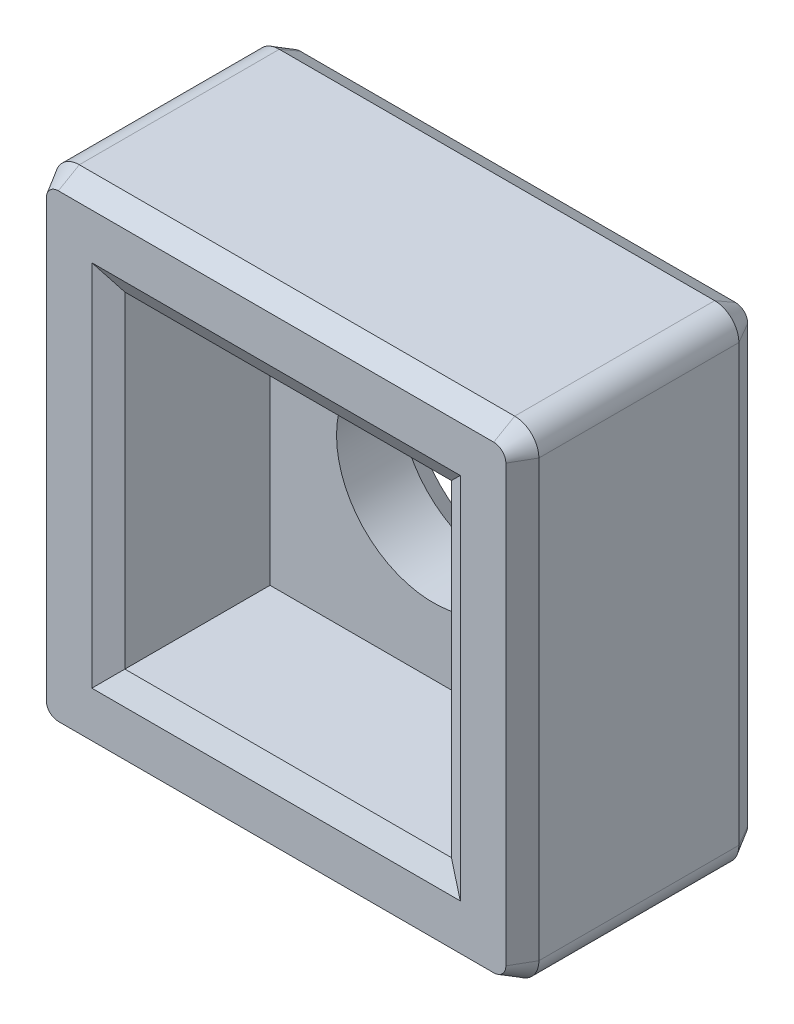
ISO-10303-21;
HEADER;
FILE_DESCRIPTION(('STEP AP214'),'2;1');
FILE_NAME('part.step','',(''),(''),'','','');
FILE_SCHEMA(('AUTOMOTIVE_DESIGN { 1 0 10303 214 1 1 1 1 }'));
ENDSEC;
DATA;
#1=APPLICATION_CONTEXT('core data for automotive mechanical design processes');
#2=APPLICATION_PROTOCOL_DEFINITION('international standard','automotive_design',2000,#1);
#3=PRODUCT_CONTEXT('',#1,'mechanical');
#4=PRODUCT('Part','Part','',(#3));
#5=PRODUCT_RELATED_PRODUCT_CATEGORY('part','',(#4));
#6=PRODUCT_DEFINITION_FORMATION('','',#4);
#7=PRODUCT_DEFINITION_CONTEXT('part definition',#1,'design');
#8=PRODUCT_DEFINITION('design','',#6,#7);
#9=PRODUCT_DEFINITION_SHAPE('','',#8);
#10=(LENGTH_UNIT() NAMED_UNIT(*) SI_UNIT(.MILLI.,.METRE.));
#11=(NAMED_UNIT(*) PLANE_ANGLE_UNIT() SI_UNIT($,.RADIAN.));
#12=(NAMED_UNIT(*) SI_UNIT($,.STERADIAN.) SOLID_ANGLE_UNIT());
#13=UNCERTAINTY_MEASURE_WITH_UNIT(LENGTH_MEASURE(1.E-05),#10,'distance_accuracy_value','');
#14=(GEOMETRIC_REPRESENTATION_CONTEXT(3) GLOBAL_UNCERTAINTY_ASSIGNED_CONTEXT((#13)) GLOBAL_UNIT_ASSIGNED_CONTEXT((#10,
#11,#12)) REPRESENTATION_CONTEXT('',''));
#15=CARTESIAN_POINT('',(0.,0.,0.));
#16=DIRECTION('',(0.,0.,1.));
#17=DIRECTION('',(1.,0.,0.));
#18=AXIS2_PLACEMENT_3D('',#15,#16,#17);
#19=CARTESIAN_POINT('',(0.,0.,4.));
#20=DIRECTION('',(0.,0.,-1.));
#21=DIRECTION('',(-1.,0.,0.));
#22=AXIS2_PLACEMENT_3D('',#19,#20,#21);
#23=CYLINDRICAL_SURFACE('',#22,1.6);
#24=CARTESIAN_POINT('',(0.,0.,0.346410161513775));
#25=DIRECTION('',(0.,0.,1.));
#26=DIRECTION('',(1.,0.,0.));
#27=AXIS2_PLACEMENT_3D('',#24,#25,#26);
#28=CIRCLE('',#27,1.6);
#29=CARTESIAN_POINT('',(1.6,0.,0.346410161513775));
#30=VERTEX_POINT('',#29);
#31=EDGE_CURVE('E351',#30,#30,#28,.F.);
#32=ORIENTED_EDGE('',*,*,#31,.T.);
#33=EDGE_LOOP('',(#32));
#34=FACE_BOUND('',#33,.T.);
#35=CARTESIAN_POINT('',(0.,0.,1.4));
#36=DIRECTION('',(0.,0.,1.));
#37=DIRECTION('',(1.,0.,0.));
#38=AXIS2_PLACEMENT_3D('',#35,#36,#37);
#39=CIRCLE('',#38,1.6);
#40=CARTESIAN_POINT('',(1.6,0.,1.4));
#41=VERTEX_POINT('',#40);
#42=EDGE_CURVE('E221',#41,#41,#39,.T.);
#43=ORIENTED_EDGE('',*,*,#42,.T.);
#44=EDGE_LOOP('',(#43));
#45=FACE_BOUND('',#44,.T.);
#46=ADVANCED_FACE('F43',(#34,#45),#23,.F.);
#47=CARTESIAN_POINT('',(-4.,4.,4.));
#48=DIRECTION('',(1.,0.,0.));
#49=DIRECTION('',(0.,0.,-1.));
#50=AXIS2_PLACEMENT_3D('',#47,#48,#49);
#51=PLANE('',#50);
#52=DIRECTION('',(0.,0.,-1.));
#53=VECTOR('',#52,1.);
#54=CARTESIAN_POINT('',(-4.,3.6,4.));
#55=LINE('',#54,#53);
#56=CARTESIAN_POINT('',(-4.,3.6,3.65358983848622));
#57=VERTEX_POINT('',#56);
#58=CARTESIAN_POINT('',(-4.,3.6,0.346410161513775));
#59=VERTEX_POINT('',#58);
#60=EDGE_CURVE('E248',#57,#59,#55,.T.);
#61=ORIENTED_EDGE('',*,*,#60,.T.);
#62=DIRECTION('',(0.,-1.,0.));
#63=VECTOR('',#62,1.);
#64=CARTESIAN_POINT('',(-4.,4.,0.346410161513775));
#65=LINE('',#64,#63);
#66=CARTESIAN_POINT('',(-4.,-3.6,0.346410161513775));
#67=VERTEX_POINT('',#66);
#68=EDGE_CURVE('E336',#59,#67,#65,.T.);
#69=ORIENTED_EDGE('',*,*,#68,.T.);
#70=DIRECTION('',(0.,0.,-1.));
#71=VECTOR('',#70,1.);
#72=CARTESIAN_POINT('',(-4.,-3.6,4.));
#73=LINE('',#72,#71);
#74=CARTESIAN_POINT('',(-4.,-3.6,3.65358983848622));
#75=VERTEX_POINT('',#74);
#76=EDGE_CURVE('E252',#67,#75,#73,.F.);
#77=ORIENTED_EDGE('',*,*,#76,.T.);
#78=DIRECTION('',(0.,1.,0.));
#79=VECTOR('',#78,1.);
#80=CARTESIAN_POINT('',(-4.,3.6,3.65358983848622));
#81=LINE('',#80,#79);
#82=EDGE_CURVE('E333',#75,#57,#81,.T.);
#83=ORIENTED_EDGE('',*,*,#82,.T.);
#84=EDGE_LOOP('',(#61,#69,#77,#83));
#85=FACE_BOUND('',#84,.T.);
#86=ADVANCED_FACE('F499',(#85),#51,.F.);
#87=CARTESIAN_POINT('',(-4.,-4.,4.));
#88=DIRECTION('',(0.,1.,0.));
#89=DIRECTION('',(0.,0.,1.));
#90=AXIS2_PLACEMENT_3D('',#87,#88,#89);
#91=PLANE('',#90);
#92=DIRECTION('',(0.,0.,-1.));
#93=VECTOR('',#92,1.);
#94=CARTESIAN_POINT('',(-3.6,-4.,4.));
#95=LINE('',#94,#93);
#96=CARTESIAN_POINT('',(-3.6,-4.,3.65358983848622));
#97=VERTEX_POINT('',#96);
#98=CARTESIAN_POINT('',(-3.6,-4.,0.346410161513775));
#99=VERTEX_POINT('',#98);
#100=EDGE_CURVE('E244',#97,#99,#95,.T.);
#101=ORIENTED_EDGE('',*,*,#100,.T.);
#102=DIRECTION('',(1.,0.,0.));
#103=VECTOR('',#102,1.);
#104=CARTESIAN_POINT('',(-4.,-4.,0.346410161513775));
#105=LINE('',#104,#103);
#106=CARTESIAN_POINT('',(3.6,-4.,0.346410161513775));
#107=VERTEX_POINT('',#106);
#108=EDGE_CURVE('E348',#99,#107,#105,.T.);
#109=ORIENTED_EDGE('',*,*,#108,.T.);
#110=DIRECTION('',(0.,0.,-1.));
#111=VECTOR('',#110,1.);
#112=CARTESIAN_POINT('',(3.6,-4.,4.));
#113=LINE('',#112,#111);
#114=CARTESIAN_POINT('',(3.6,-4.,3.65358983848622));
#115=VERTEX_POINT('',#114);
#116=EDGE_CURVE('E235',#107,#115,#113,.F.);
#117=ORIENTED_EDGE('',*,*,#116,.T.);
#118=DIRECTION('',(-1.,0.,0.));
#119=VECTOR('',#118,1.);
#120=CARTESIAN_POINT('',(-3.6,-4.,3.65358983848622));
#121=LINE('',#120,#119);
#122=EDGE_CURVE('E345',#115,#97,#121,.T.);
#123=ORIENTED_EDGE('',*,*,#122,.T.);
#124=EDGE_LOOP('',(#101,#109,#117,#123));
#125=FACE_BOUND('',#124,.T.);
#126=ADVANCED_FACE('F505',(#125),#91,.F.);
#127=CARTESIAN_POINT('',(4.,4.,4.));
#128=DIRECTION('',(-1.,0.,0.));
#129=DIRECTION('',(0.,-1.,0.));
#130=AXIS2_PLACEMENT_3D('',#127,#128,#129);
#131=PLANE('',#130);
#132=DIRECTION('',(0.,0.,-1.));
#133=VECTOR('',#132,1.);
#134=CARTESIAN_POINT('',(4.,-3.6,4.));
#135=LINE('',#134,#133);
#136=CARTESIAN_POINT('',(4.,-3.6,3.65358983848622));
#137=VERTEX_POINT('',#136);
#138=CARTESIAN_POINT('',(4.,-3.6,0.346410161513775));
#139=VERTEX_POINT('',#138);
#140=EDGE_CURVE('E260',#137,#139,#135,.T.);
#141=ORIENTED_EDGE('',*,*,#140,.T.);
#142=DIRECTION('',(0.,1.,0.));
#143=VECTOR('',#142,1.);
#144=CARTESIAN_POINT('',(4.,4.,0.346410161513775));
#145=LINE('',#144,#143);
#146=CARTESIAN_POINT('',(4.,3.6,0.346410161513775));
#147=VERTEX_POINT('',#146);
#148=EDGE_CURVE('E311',#139,#147,#145,.T.);
#149=ORIENTED_EDGE('',*,*,#148,.T.);
#150=DIRECTION('',(0.,0.,-1.));
#151=VECTOR('',#150,1.);
#152=CARTESIAN_POINT('',(4.,3.6,4.));
#153=LINE('',#152,#151);
#154=CARTESIAN_POINT('',(4.,3.6,3.65358983848622));
#155=VERTEX_POINT('',#154);
#156=EDGE_CURVE('E256',#147,#155,#153,.F.);
#157=ORIENTED_EDGE('',*,*,#156,.T.);
#158=DIRECTION('',(0.,-1.,0.));
#159=VECTOR('',#158,1.);
#160=CARTESIAN_POINT('',(4.,-3.6,3.65358983848622));
#161=LINE('',#160,#159);
#162=EDGE_CURVE('E308',#155,#137,#161,.T.);
#163=ORIENTED_EDGE('',*,*,#162,.T.);
#164=EDGE_LOOP('',(#141,#149,#157,#163));
#165=FACE_BOUND('',#164,.T.);
#166=ADVANCED_FACE('F522',(#165),#131,.F.);
#167=CARTESIAN_POINT('',(-4.,4.,4.));
#168=DIRECTION('',(0.,-1.,0.));
#169=DIRECTION('',(0.,0.,-1.));
#170=AXIS2_PLACEMENT_3D('',#167,#168,#169);
#171=PLANE('',#170);
#172=DIRECTION('',(0.,0.,-1.));
#173=VECTOR('',#172,1.);
#174=CARTESIAN_POINT('',(3.6,4.,4.));
#175=LINE('',#174,#173);
#176=CARTESIAN_POINT('',(3.6,4.,3.65358983848622));
#177=VERTEX_POINT('',#176);
#178=CARTESIAN_POINT('',(3.6,4.,0.346410161513775));
#179=VERTEX_POINT('',#178);
#180=EDGE_CURVE('E268',#177,#179,#175,.T.);
#181=ORIENTED_EDGE('',*,*,#180,.T.);
#182=DIRECTION('',(-1.,0.,0.));
#183=VECTOR('',#182,1.);
#184=CARTESIAN_POINT('',(-4.,4.,0.346410161513775));
#185=LINE('',#184,#183);
#186=CARTESIAN_POINT('',(-3.6,4.,0.346410161513775));
#187=VERTEX_POINT('',#186);
#188=EDGE_CURVE('E323',#179,#187,#185,.T.);
#189=ORIENTED_EDGE('',*,*,#188,.T.);
#190=DIRECTION('',(0.,0.,-1.));
#191=VECTOR('',#190,1.);
#192=CARTESIAN_POINT('',(-3.6,4.,4.));
#193=LINE('',#192,#191);
#194=CARTESIAN_POINT('',(-3.6,4.,3.65358983848622));
#195=VERTEX_POINT('',#194);
#196=EDGE_CURVE('E264',#187,#195,#193,.F.);
#197=ORIENTED_EDGE('',*,*,#196,.T.);
#198=DIRECTION('',(1.,0.,0.));
#199=VECTOR('',#198,1.);
#200=CARTESIAN_POINT('',(3.6,4.,3.65358983848622));
#201=LINE('',#200,#199);
#202=EDGE_CURVE('E320',#195,#177,#201,.T.);
#203=ORIENTED_EDGE('',*,*,#202,.T.);
#204=EDGE_LOOP('',(#181,#189,#197,#203));
#205=FACE_BOUND('',#204,.T.);
#206=ADVANCED_FACE('F514',(#205),#171,.F.);
#207=CARTESIAN_POINT('',(0.,0.,4.));
#208=DIRECTION('',(0.,0.,1.));
#209=DIRECTION('',(1.,0.,0.));
#210=AXIS2_PLACEMENT_3D('',#207,#208,#209);
#211=PLANE('',#210);
#212=DIRECTION('',(-1.,0.,0.));
#213=VECTOR('',#212,1.);
#214=CARTESIAN_POINT('',(-3.6,3.8,4.));
#215=LINE('',#214,#213);
#216=CARTESIAN_POINT('',(3.6,3.8,4.));
#217=VERTEX_POINT('',#216);
#218=CARTESIAN_POINT('',(-3.6,3.8,4.));
#219=VERTEX_POINT('',#218);
#220=EDGE_CURVE('E386',#217,#219,#215,.T.);
#221=ORIENTED_EDGE('',*,*,#220,.T.);
#222=CARTESIAN_POINT('',(-3.6,3.6,4.));
#223=DIRECTION('',(0.,0.,1.));
#224=DIRECTION('',(1.,0.,0.));
#225=AXIS2_PLACEMENT_3D('',#222,#223,#224);
#226=CIRCLE('',#225,0.199999999999998);
#227=CARTESIAN_POINT('',(-3.8,3.6,4.));
#228=VERTEX_POINT('',#227);
#229=EDGE_CURVE('E389',#219,#228,#226,.T.);
#230=ORIENTED_EDGE('',*,*,#229,.T.);
#231=DIRECTION('',(0.,-1.,0.));
#232=VECTOR('',#231,1.);
#233=CARTESIAN_POINT('',(-3.8,-3.6,4.));
#234=LINE('',#233,#232);
#235=CARTESIAN_POINT('',(-3.8,-3.6,4.));
#236=VERTEX_POINT('',#235);
#237=EDGE_CURVE('E368',#228,#236,#234,.T.);
#238=ORIENTED_EDGE('',*,*,#237,.T.);
#239=CARTESIAN_POINT('',(-3.6,-3.6,4.));
#240=DIRECTION('',(0.,0.,1.));
#241=DIRECTION('',(1.,0.,0.));
#242=AXIS2_PLACEMENT_3D('',#239,#240,#241);
#243=CIRCLE('',#242,0.199999999999998);
#244=CARTESIAN_POINT('',(-3.6,-3.8,4.));
#245=VERTEX_POINT('',#244);
#246=EDGE_CURVE('E371',#236,#245,#243,.T.);
#247=ORIENTED_EDGE('',*,*,#246,.T.);
#248=DIRECTION('',(1.,0.,0.));
#249=VECTOR('',#248,1.);
#250=CARTESIAN_POINT('',(3.6,-3.8,4.));
#251=LINE('',#250,#249);
#252=CARTESIAN_POINT('',(3.6,-3.8,4.));
#253=VERTEX_POINT('',#252);
#254=EDGE_CURVE('E374',#245,#253,#251,.T.);
#255=ORIENTED_EDGE('',*,*,#254,.T.);
#256=CARTESIAN_POINT('',(3.6,-3.6,4.));
#257=DIRECTION('',(0.,0.,1.));
#258=DIRECTION('',(1.,0.,0.));
#259=AXIS2_PLACEMENT_3D('',#256,#257,#258);
#260=CIRCLE('',#259,0.199999999999998);
#261=CARTESIAN_POINT('',(3.8,-3.6,4.));
#262=VERTEX_POINT('',#261);
#263=EDGE_CURVE('E377',#253,#262,#260,.T.);
#264=ORIENTED_EDGE('',*,*,#263,.T.);
#265=DIRECTION('',(0.,1.,0.));
#266=VECTOR('',#265,1.);
#267=CARTESIAN_POINT('',(3.8,3.6,4.));
#268=LINE('',#267,#266);
#269=CARTESIAN_POINT('',(3.8,3.6,4.));
#270=VERTEX_POINT('',#269);
#271=EDGE_CURVE('E380',#262,#270,#268,.T.);
#272=ORIENTED_EDGE('',*,*,#271,.T.);
#273=CARTESIAN_POINT('',(3.6,3.6,4.));
#274=DIRECTION('',(0.,0.,1.));
#275=DIRECTION('',(1.,0.,0.));
#276=AXIS2_PLACEMENT_3D('',#273,#274,#275);
#277=CIRCLE('',#276,0.199999999999998);
#278=EDGE_CURVE('E383',#270,#217,#277,.T.);
#279=ORIENTED_EDGE('',*,*,#278,.T.);
#280=EDGE_LOOP('',(#221,#230,#238,#247,#255,#264,#272,#279));
#281=FACE_BOUND('',#280,.T.);
#282=DIRECTION('',(0.,-1.,0.));
#283=VECTOR('',#282,1.);
#284=CARTESIAN_POINT('',(3.04641016151378,-2.7,4.));
#285=LINE('',#284,#283);
#286=CARTESIAN_POINT('',(3.04641016151378,3.04641016151378,4.));
#287=VERTEX_POINT('',#286);
#288=CARTESIAN_POINT('',(3.04641016151378,-3.04641016151378,4.));
#289=VERTEX_POINT('',#288);
#290=EDGE_CURVE('E361',#287,#289,#285,.T.);
#291=ORIENTED_EDGE('',*,*,#290,.T.);
#292=DIRECTION('',(-1.,0.,0.));
#293=VECTOR('',#292,1.);
#294=CARTESIAN_POINT('',(-2.7,-3.04641016151378,4.));
#295=LINE('',#294,#293);
#296=CARTESIAN_POINT('',(-3.04641016151378,-3.04641016151378,4.));
#297=VERTEX_POINT('',#296);
#298=EDGE_CURVE('E364',#289,#297,#295,.T.);
#299=ORIENTED_EDGE('',*,*,#298,.T.);
#300=DIRECTION('',(0.,1.,0.));
#301=VECTOR('',#300,1.);
#302=CARTESIAN_POINT('',(-3.04641016151378,2.7,4.));
#303=LINE('',#302,#301);
#304=CARTESIAN_POINT('',(-3.04641016151378,3.04641016151378,4.));
#305=VERTEX_POINT('',#304);
#306=EDGE_CURVE('E355',#297,#305,#303,.T.);
#307=ORIENTED_EDGE('',*,*,#306,.T.);
#308=DIRECTION('',(1.,0.,0.));
#309=VECTOR('',#308,1.);
#310=CARTESIAN_POINT('',(2.7,3.04641016151378,4.));
#311=LINE('',#310,#309);
#312=EDGE_CURVE('E358',#305,#287,#311,.T.);
#313=ORIENTED_EDGE('',*,*,#312,.T.);
#314=EDGE_LOOP('',(#291,#299,#307,#313));
#315=FACE_BOUND('',#314,.T.);
#316=ADVANCED_FACE('F479',(#281,#315),#211,.T.);
#317=CARTESIAN_POINT('',(0.,0.,0.));
#318=DIRECTION('',(0.,0.,1.));
#319=DIRECTION('',(1.,0.,0.));
#320=AXIS2_PLACEMENT_3D('',#317,#318,#319);
#321=PLANE('',#320);
#322=DIRECTION('',(0.,-1.,0.));
#323=VECTOR('',#322,1.);
#324=CARTESIAN_POINT('',(3.8,0.,0.));
#325=LINE('',#324,#323);
#326=CARTESIAN_POINT('',(3.8,3.6,0.));
#327=VERTEX_POINT('',#326);
#328=CARTESIAN_POINT('',(3.8,-3.6,0.));
#329=VERTEX_POINT('',#328);
#330=EDGE_CURVE('E294',#327,#329,#325,.T.);
#331=ORIENTED_EDGE('',*,*,#330,.T.);
#332=CARTESIAN_POINT('',(3.6,-3.6,0.));
#333=DIRECTION('',(0.,0.,1.));
#334=DIRECTION('',(1.,0.,0.));
#335=AXIS2_PLACEMENT_3D('',#332,#333,#334);
#336=CIRCLE('',#335,0.200000000000001);
#337=CARTESIAN_POINT('',(3.6,-3.8,0.));
#338=VERTEX_POINT('',#337);
#339=EDGE_CURVE('E297',#329,#338,#336,.F.);
#340=ORIENTED_EDGE('',*,*,#339,.T.);
#341=DIRECTION('',(-1.,0.,0.));
#342=VECTOR('',#341,1.);
#343=CARTESIAN_POINT('',(0.,-3.8,0.));
#344=LINE('',#343,#342);
#345=CARTESIAN_POINT('',(-3.6,-3.8,0.));
#346=VERTEX_POINT('',#345);
#347=EDGE_CURVE('E276',#338,#346,#344,.T.);
#348=ORIENTED_EDGE('',*,*,#347,.T.);
#349=CARTESIAN_POINT('',(-3.6,-3.6,0.));
#350=DIRECTION('',(0.,0.,1.));
#351=DIRECTION('',(1.,0.,0.));
#352=AXIS2_PLACEMENT_3D('',#349,#350,#351);
#353=CIRCLE('',#352,0.200000000000001);
#354=CARTESIAN_POINT('',(-3.8,-3.6,0.));
#355=VERTEX_POINT('',#354);
#356=EDGE_CURVE('E279',#346,#355,#353,.F.);
#357=ORIENTED_EDGE('',*,*,#356,.T.);
#358=DIRECTION('',(0.,1.,0.));
#359=VECTOR('',#358,1.);
#360=CARTESIAN_POINT('',(-3.8,0.,0.));
#361=LINE('',#360,#359);
#362=CARTESIAN_POINT('',(-3.8,3.6,0.));
#363=VERTEX_POINT('',#362);
#364=EDGE_CURVE('E282',#355,#363,#361,.T.);
#365=ORIENTED_EDGE('',*,*,#364,.T.);
#366=CARTESIAN_POINT('',(-3.6,3.6,0.));
#367=DIRECTION('',(0.,0.,1.));
#368=DIRECTION('',(1.,0.,0.));
#369=AXIS2_PLACEMENT_3D('',#366,#367,#368);
#370=CIRCLE('',#369,0.200000000000001);
#371=CARTESIAN_POINT('',(-3.6,3.8,0.));
#372=VERTEX_POINT('',#371);
#373=EDGE_CURVE('E285',#363,#372,#370,.F.);
#374=ORIENTED_EDGE('',*,*,#373,.T.);
#375=DIRECTION('',(1.,0.,0.));
#376=VECTOR('',#375,1.);
#377=CARTESIAN_POINT('',(0.,3.8,0.));
#378=LINE('',#377,#376);
#379=CARTESIAN_POINT('',(3.6,3.8,0.));
#380=VERTEX_POINT('',#379);
#381=EDGE_CURVE('E288',#372,#380,#378,.T.);
#382=ORIENTED_EDGE('',*,*,#381,.T.);
#383=CARTESIAN_POINT('',(3.6,3.6,0.));
#384=DIRECTION('',(0.,0.,1.));
#385=DIRECTION('',(1.,0.,0.));
#386=AXIS2_PLACEMENT_3D('',#383,#384,#385);
#387=CIRCLE('',#386,0.200000000000001);
#388=EDGE_CURVE('E291',#380,#327,#387,.F.);
#389=ORIENTED_EDGE('',*,*,#388,.T.);
#390=EDGE_LOOP('',(#331,#340,#348,#357,#365,#374,#382,#389));
#391=FACE_BOUND('',#390,.T.);
#392=CARTESIAN_POINT('',(0.,0.,0.));
#393=DIRECTION('',(0.,0.,1.));
#394=DIRECTION('',(1.,0.,0.));
#395=AXIS2_PLACEMENT_3D('',#392,#393,#394);
#396=CIRCLE('',#395,1.8);
#397=CARTESIAN_POINT('',(1.8,0.,0.));
#398=VERTEX_POINT('',#397);
#399=EDGE_CURVE('E272',#398,#398,#396,.T.);
#400=ORIENTED_EDGE('',*,*,#399,.T.);
#401=EDGE_LOOP('',(#400));
#402=FACE_BOUND('',#401,.T.);
#403=ADVANCED_FACE('F513',(#391,#402),#321,.F.);
#404=CARTESIAN_POINT('',(-3.6,-3.6,4.));
#405=DIRECTION('',(0.,0.,-1.));
#406=DIRECTION('',(-1.,0.,0.));
#407=AXIS2_PLACEMENT_3D('',#404,#405,#406);
#408=CYLINDRICAL_SURFACE('',#407,0.4);
#409=ORIENTED_EDGE('',*,*,#76,.F.);
#410=CARTESIAN_POINT('',(-3.6,-3.6,0.346410161513775));
#411=DIRECTION('',(0.,0.,1.));
#412=DIRECTION('',(1.,0.,0.));
#413=AXIS2_PLACEMENT_3D('',#410,#411,#412);
#414=CIRCLE('',#413,0.4);
#415=EDGE_CURVE('E342',#67,#99,#414,.T.);
#416=ORIENTED_EDGE('',*,*,#415,.T.);
#417=ORIENTED_EDGE('',*,*,#100,.F.);
#418=CARTESIAN_POINT('',(-3.6,-3.6,3.65358983848622));
#419=DIRECTION('',(0.,0.,1.));
#420=DIRECTION('',(1.,0.,0.));
#421=AXIS2_PLACEMENT_3D('',#418,#419,#420);
#422=CIRCLE('',#421,0.4);
#423=EDGE_CURVE('E339',#97,#75,#422,.F.);
#424=ORIENTED_EDGE('',*,*,#423,.T.);
#425=EDGE_LOOP('',(#409,#416,#417,#424));
#426=FACE_BOUND('',#425,.T.);
#427=ADVANCED_FACE('F518',(#426),#408,.T.);
#428=CARTESIAN_POINT('',(3.6,-3.6,4.));
#429=DIRECTION('',(0.,0.,-1.));
#430=DIRECTION('',(-1.,0.,0.));
#431=AXIS2_PLACEMENT_3D('',#428,#429,#430);
#432=CYLINDRICAL_SURFACE('',#431,0.4);
#433=ORIENTED_EDGE('',*,*,#116,.F.);
#434=CARTESIAN_POINT('',(3.6,-3.6,0.346410161513775));
#435=DIRECTION('',(0.,0.,1.));
#436=DIRECTION('',(1.,0.,0.));
#437=AXIS2_PLACEMENT_3D('',#434,#435,#436);
#438=CIRCLE('',#437,0.4);
#439=EDGE_CURVE('E304',#107,#139,#438,.T.);
#440=ORIENTED_EDGE('',*,*,#439,.T.);
#441=ORIENTED_EDGE('',*,*,#140,.F.);
#442=CARTESIAN_POINT('',(3.6,-3.6,3.65358983848622));
#443=DIRECTION('',(0.,0.,1.));
#444=DIRECTION('',(1.,0.,0.));
#445=AXIS2_PLACEMENT_3D('',#442,#443,#444);
#446=CIRCLE('',#445,0.4);
#447=EDGE_CURVE('E301',#137,#115,#446,.F.);
#448=ORIENTED_EDGE('',*,*,#447,.T.);
#449=EDGE_LOOP('',(#433,#440,#441,#448));
#450=FACE_BOUND('',#449,.T.);
#451=ADVANCED_FACE('F532',(#450),#432,.T.);
#452=CARTESIAN_POINT('',(3.6,3.6,4.));
#453=DIRECTION('',(0.,0.,-1.));
#454=DIRECTION('',(-1.,0.,0.));
#455=AXIS2_PLACEMENT_3D('',#452,#453,#454);
#456=CYLINDRICAL_SURFACE('',#455,0.4);
#457=ORIENTED_EDGE('',*,*,#156,.F.);
#458=CARTESIAN_POINT('',(3.6,3.6,0.346410161513775));
#459=DIRECTION('',(0.,0.,1.));
#460=DIRECTION('',(1.,0.,0.));
#461=AXIS2_PLACEMENT_3D('',#458,#459,#460);
#462=CIRCLE('',#461,0.4);
#463=EDGE_CURVE('E317',#147,#179,#462,.T.);
#464=ORIENTED_EDGE('',*,*,#463,.T.);
#465=ORIENTED_EDGE('',*,*,#180,.F.);
#466=CARTESIAN_POINT('',(3.6,3.6,3.65358983848622));
#467=DIRECTION('',(0.,0.,1.));
#468=DIRECTION('',(1.,0.,0.));
#469=AXIS2_PLACEMENT_3D('',#466,#467,#468);
#470=CIRCLE('',#469,0.4);
#471=EDGE_CURVE('E314',#177,#155,#470,.F.);
#472=ORIENTED_EDGE('',*,*,#471,.T.);
#473=EDGE_LOOP('',(#457,#464,#465,#472));
#474=FACE_BOUND('',#473,.T.);
#475=ADVANCED_FACE('F536',(#474),#456,.T.);
#476=CARTESIAN_POINT('',(-3.6,3.6,4.));
#477=DIRECTION('',(0.,0.,-1.));
#478=DIRECTION('',(-1.,0.,0.));
#479=AXIS2_PLACEMENT_3D('',#476,#477,#478);
#480=CYLINDRICAL_SURFACE('',#479,0.4);
#481=ORIENTED_EDGE('',*,*,#196,.F.);
#482=CARTESIAN_POINT('',(-3.6,3.6,0.346410161513775));
#483=DIRECTION('',(0.,0.,1.));
#484=DIRECTION('',(1.,0.,0.));
#485=AXIS2_PLACEMENT_3D('',#482,#483,#484);
#486=CIRCLE('',#485,0.4);
#487=EDGE_CURVE('E330',#187,#59,#486,.T.);
#488=ORIENTED_EDGE('',*,*,#487,.T.);
#489=ORIENTED_EDGE('',*,*,#60,.F.);
#490=CARTESIAN_POINT('',(-3.6,3.6,3.65358983848622));
#491=DIRECTION('',(0.,0.,1.));
#492=DIRECTION('',(1.,0.,0.));
#493=AXIS2_PLACEMENT_3D('',#490,#491,#492);
#494=CIRCLE('',#493,0.4);
#495=EDGE_CURVE('E326',#57,#195,#494,.F.);
#496=ORIENTED_EDGE('',*,*,#495,.T.);
#497=EDGE_LOOP('',(#481,#488,#489,#496));
#498=FACE_BOUND('',#497,.T.);
#499=ADVANCED_FACE('F495',(#498),#480,.T.);
#500=CARTESIAN_POINT('',(-2.7,2.7,1.4));
#501=DIRECTION('',(-1.,0.,0.));
#502=DIRECTION('',(0.,-1.,0.));
#503=AXIS2_PLACEMENT_3D('',#500,#501,#502);
#504=PLANE('',#503);
#505=DIRECTION('',(0.,0.,1.));
#506=VECTOR('',#505,1.);
#507=CARTESIAN_POINT('',(-2.7,2.7,1.4));
#508=LINE('',#507,#506);
#509=CARTESIAN_POINT('',(-2.7,2.7,1.4));
#510=VERTEX_POINT('',#509);
#511=CARTESIAN_POINT('',(-2.7,2.7,3.8));
#512=VERTEX_POINT('',#511);
#513=EDGE_CURVE('E232',#510,#512,#508,.T.);
#514=ORIENTED_EDGE('',*,*,#513,.T.);
#515=DIRECTION('',(0.,-1.,0.));
#516=VECTOR('',#515,1.);
#517=CARTESIAN_POINT('',(-2.7,-2.7,3.8));
#518=LINE('',#517,#516);
#519=CARTESIAN_POINT('',(-2.7,-2.7,3.8));
#520=VERTEX_POINT('',#519);
#521=EDGE_CURVE('E11',#512,#520,#518,.T.);
#522=ORIENTED_EDGE('',*,*,#521,.T.);
#523=DIRECTION('',(0.,0.,1.));
#524=VECTOR('',#523,1.);
#525=CARTESIAN_POINT('',(-2.7,-2.7,1.4));
#526=LINE('',#525,#524);
#527=CARTESIAN_POINT('',(-2.7,-2.7,1.4));
#528=VERTEX_POINT('',#527);
#529=EDGE_CURVE('E195',#528,#520,#526,.T.);
#530=ORIENTED_EDGE('',*,*,#529,.F.);
#531=DIRECTION('',(0.,-1.,0.));
#532=VECTOR('',#531,1.);
#533=CARTESIAN_POINT('',(-2.7,2.7,1.4));
#534=LINE('',#533,#532);
#535=EDGE_CURVE('E199',#510,#528,#534,.T.);
#536=ORIENTED_EDGE('',*,*,#535,.F.);
#537=EDGE_LOOP('',(#514,#522,#530,#536));
#538=FACE_BOUND('',#537,.T.);
#539=ADVANCED_FACE('F197',(#538),#504,.F.);
#540=CARTESIAN_POINT('',(-2.7,2.7,1.4));
#541=DIRECTION('',(0.,1.,0.));
#542=DIRECTION('',(0.,0.,1.));
#543=AXIS2_PLACEMENT_3D('',#540,#541,#542);
#544=PLANE('',#543);
#545=DIRECTION('',(0.,0.,1.));
#546=VECTOR('',#545,1.);
#547=CARTESIAN_POINT('',(2.7,2.7,1.4));
#548=LINE('',#547,#546);
#549=CARTESIAN_POINT('',(2.7,2.7,1.4));
#550=VERTEX_POINT('',#549);
#551=CARTESIAN_POINT('',(2.7,2.7,3.8));
#552=VERTEX_POINT('',#551);
#553=EDGE_CURVE('E236',#550,#552,#548,.T.);
#554=ORIENTED_EDGE('',*,*,#553,.T.);
#555=DIRECTION('',(-1.,0.,0.));
#556=VECTOR('',#555,1.);
#557=CARTESIAN_POINT('',(-2.7,2.7,3.8));
#558=LINE('',#557,#556);
#559=EDGE_CURVE('E54',#552,#512,#558,.T.);
#560=ORIENTED_EDGE('',*,*,#559,.T.);
#561=ORIENTED_EDGE('',*,*,#513,.F.);
#562=DIRECTION('',(-1.,0.,0.));
#563=VECTOR('',#562,1.);
#564=CARTESIAN_POINT('',(-2.7,2.7,1.4));
#565=LINE('',#564,#563);
#566=EDGE_CURVE('E207',#550,#510,#565,.T.);
#567=ORIENTED_EDGE('',*,*,#566,.F.);
#568=EDGE_LOOP('',(#554,#560,#561,#567));
#569=FACE_BOUND('',#568,.T.);
#570=ADVANCED_FACE('F487',(#569),#544,.F.);
#571=CARTESIAN_POINT('',(2.7,2.7,1.4));
#572=DIRECTION('',(1.,0.,0.));
#573=DIRECTION('',(0.,1.,0.));
#574=AXIS2_PLACEMENT_3D('',#571,#572,#573);
#575=PLANE('',#574);
#576=DIRECTION('',(0.,0.,1.));
#577=VECTOR('',#576,1.);
#578=CARTESIAN_POINT('',(2.7,-2.7,1.4));
#579=LINE('',#578,#577);
#580=CARTESIAN_POINT('',(2.7,-2.7,1.4));
#581=VERTEX_POINT('',#580);
#582=CARTESIAN_POINT('',(2.7,-2.7,3.8));
#583=VERTEX_POINT('',#582);
#584=EDGE_CURVE('E206',#581,#583,#579,.T.);
#585=ORIENTED_EDGE('',*,*,#584,.T.);
#586=DIRECTION('',(0.,1.,0.));
#587=VECTOR('',#586,1.);
#588=CARTESIAN_POINT('',(2.7,2.7,3.8));
#589=LINE('',#588,#587);
#590=EDGE_CURVE('E69',#583,#552,#589,.T.);
#591=ORIENTED_EDGE('',*,*,#590,.T.);
#592=ORIENTED_EDGE('',*,*,#553,.F.);
#593=DIRECTION('',(0.,1.,0.));
#594=VECTOR('',#593,1.);
#595=CARTESIAN_POINT('',(2.7,2.7,1.4));
#596=LINE('',#595,#594);
#597=EDGE_CURVE('E216',#581,#550,#596,.T.);
#598=ORIENTED_EDGE('',*,*,#597,.F.);
#599=EDGE_LOOP('',(#585,#591,#592,#598));
#600=FACE_BOUND('',#599,.T.);
#601=ADVANCED_FACE('F486',(#600),#575,.F.);
#602=CARTESIAN_POINT('',(-2.7,-2.7,1.4));
#603=DIRECTION('',(0.,-1.,0.));
#604=DIRECTION('',(0.,0.,-1.));
#605=AXIS2_PLACEMENT_3D('',#602,#603,#604);
#606=PLANE('',#605);
#607=ORIENTED_EDGE('',*,*,#529,.T.);
#608=DIRECTION('',(1.,0.,0.));
#609=VECTOR('',#608,1.);
#610=CARTESIAN_POINT('',(2.7,-2.7,3.8));
#611=LINE('',#610,#609);
#612=EDGE_CURVE('E393',#520,#583,#611,.T.);
#613=ORIENTED_EDGE('',*,*,#612,.T.);
#614=ORIENTED_EDGE('',*,*,#584,.F.);
#615=DIRECTION('',(1.,0.,0.));
#616=VECTOR('',#615,1.);
#617=CARTESIAN_POINT('',(-2.7,-2.7,1.4));
#618=LINE('',#617,#616);
#619=EDGE_CURVE('E210',#528,#581,#618,.T.);
#620=ORIENTED_EDGE('',*,*,#619,.F.);
#621=EDGE_LOOP('',(#607,#613,#614,#620));
#622=FACE_BOUND('',#621,.T.);
#623=ADVANCED_FACE('F211',(#622),#606,.F.);
#624=CARTESIAN_POINT('',(0.,0.,1.4));
#625=DIRECTION('',(0.,0.,1.));
#626=DIRECTION('',(1.,0.,0.));
#627=AXIS2_PLACEMENT_3D('',#624,#625,#626);
#628=PLANE('',#627);
#629=ORIENTED_EDGE('',*,*,#42,.F.);
#630=EDGE_LOOP('',(#629));
#631=FACE_BOUND('',#630,.T.);
#632=ORIENTED_EDGE('',*,*,#535,.T.);
#633=ORIENTED_EDGE('',*,*,#619,.T.);
#634=ORIENTED_EDGE('',*,*,#597,.T.);
#635=ORIENTED_EDGE('',*,*,#566,.T.);
#636=EDGE_LOOP('',(#632,#633,#634,#635));
#637=FACE_BOUND('',#636,.T.);
#638=ADVANCED_FACE('F218',(#631,#637),#628,.T.);
#639=CARTESIAN_POINT('',(-3.6,3.6,0.));
#640=DIRECTION('',(0.,0.,1.));
#641=DIRECTION('',(1.,0.,0.));
#642=AXIS2_PLACEMENT_3D('',#639,#640,#641);
#643=CONICAL_SURFACE('',#642,0.200000000000001,0.523598775598298);
#644=DIRECTION('',(0.499999999999999,0.,-0.866025403784439));
#645=VECTOR('',#644,1.);
#646=CARTESIAN_POINT('',(-4.,3.6,0.346410161513775));
#647=LINE('',#646,#645);
#648=EDGE_CURVE('E423',#59,#363,#647,.T.);
#649=ORIENTED_EDGE('',*,*,#648,.F.);
#650=ORIENTED_EDGE('',*,*,#487,.F.);
#651=DIRECTION('',(0.,0.499999999999999,0.866025403784439));
#652=VECTOR('',#651,1.);
#653=CARTESIAN_POINT('',(-3.6,3.8,0.));
#654=LINE('',#653,#652);
#655=EDGE_CURVE('E225',#372,#187,#654,.T.);
#656=ORIENTED_EDGE('',*,*,#655,.F.);
#657=ORIENTED_EDGE('',*,*,#373,.F.);
#658=EDGE_LOOP('',(#649,#650,#656,#657));
#659=FACE_BOUND('',#658,.T.);
#660=ADVANCED_FACE('F595',(#659),#643,.T.);
#661=CARTESIAN_POINT('',(-4.,4.,0.346410161513775));
#662=DIRECTION('',(0.,-0.866025403784439,0.499999999999999));
#663=DIRECTION('',(-1.,0.,0.));
#664=AXIS2_PLACEMENT_3D('',#661,#662,#663);
#665=PLANE('',#664);
#666=ORIENTED_EDGE('',*,*,#655,.T.);
#667=ORIENTED_EDGE('',*,*,#188,.F.);
#668=DIRECTION('',(0.,0.499999999999999,0.866025403784439));
#669=VECTOR('',#668,1.);
#670=CARTESIAN_POINT('',(3.6,3.8,0.));
#671=LINE('',#670,#669);
#672=EDGE_CURVE('E419',#380,#179,#671,.T.);
#673=ORIENTED_EDGE('',*,*,#672,.F.);
#674=ORIENTED_EDGE('',*,*,#381,.F.);
#675=EDGE_LOOP('',(#666,#667,#673,#674));
#676=FACE_BOUND('',#675,.T.);
#677=ADVANCED_FACE('F588',(#676),#665,.F.);
#678=CARTESIAN_POINT('',(-4.,4.,0.346410161513775));
#679=DIRECTION('',(0.866025403784439,0.,0.499999999999999));
#680=DIRECTION('',(0.,-1.,0.));
#681=AXIS2_PLACEMENT_3D('',#678,#679,#680);
#682=PLANE('',#681);
#683=ORIENTED_EDGE('',*,*,#648,.T.);
#684=ORIENTED_EDGE('',*,*,#364,.F.);
#685=DIRECTION('',(0.499999999999999,0.,-0.866025403784439));
#686=VECTOR('',#685,1.);
#687=CARTESIAN_POINT('',(-4.,-3.6,0.346410161513775));
#688=LINE('',#687,#686);
#689=EDGE_CURVE('E415',#67,#355,#688,.T.);
#690=ORIENTED_EDGE('',*,*,#689,.F.);
#691=ORIENTED_EDGE('',*,*,#68,.F.);
#692=EDGE_LOOP('',(#683,#684,#690,#691));
#693=FACE_BOUND('',#692,.T.);
#694=ADVANCED_FACE('F581',(#693),#682,.F.);
#695=CARTESIAN_POINT('',(3.6,3.6,0.));
#696=DIRECTION('',(0.,0.,1.));
#697=DIRECTION('',(1.,0.,0.));
#698=AXIS2_PLACEMENT_3D('',#695,#696,#697);
#699=CONICAL_SURFACE('',#698,0.200000000000001,0.523598775598298);
#700=ORIENTED_EDGE('',*,*,#672,.T.);
#701=ORIENTED_EDGE('',*,*,#463,.F.);
#702=DIRECTION('',(0.499999999999999,0.,0.866025403784439));
#703=VECTOR('',#702,1.);
#704=CARTESIAN_POINT('',(3.8,3.6,0.));
#705=LINE('',#704,#703);
#706=EDGE_CURVE('E411',#327,#147,#705,.T.);
#707=ORIENTED_EDGE('',*,*,#706,.F.);
#708=ORIENTED_EDGE('',*,*,#388,.F.);
#709=EDGE_LOOP('',(#700,#701,#707,#708));
#710=FACE_BOUND('',#709,.T.);
#711=ADVANCED_FACE('F574',(#710),#699,.T.);
#712=CARTESIAN_POINT('',(-3.6,-3.6,0.));
#713=DIRECTION('',(0.,0.,1.));
#714=DIRECTION('',(1.,0.,0.));
#715=AXIS2_PLACEMENT_3D('',#712,#713,#714);
#716=CONICAL_SURFACE('',#715,0.200000000000001,0.523598775598298);
#717=ORIENTED_EDGE('',*,*,#689,.T.);
#718=ORIENTED_EDGE('',*,*,#356,.F.);
#719=DIRECTION('',(0.,0.499999999999999,-0.866025403784439));
#720=VECTOR('',#719,1.);
#721=CARTESIAN_POINT('',(-3.6,-4.,0.346410161513775));
#722=LINE('',#721,#720);
#723=EDGE_CURVE('E407',#99,#346,#722,.T.);
#724=ORIENTED_EDGE('',*,*,#723,.F.);
#725=ORIENTED_EDGE('',*,*,#415,.F.);
#726=EDGE_LOOP('',(#717,#718,#724,#725));
#727=FACE_BOUND('',#726,.T.);
#728=ADVANCED_FACE('F567',(#727),#716,.T.);
#729=CARTESIAN_POINT('',(4.,4.,0.346410161513775));
#730=DIRECTION('',(-0.866025403784439,0.,0.499999999999999));
#731=DIRECTION('',(0.,1.,0.));
#732=AXIS2_PLACEMENT_3D('',#729,#730,#731);
#733=PLANE('',#732);
#734=ORIENTED_EDGE('',*,*,#706,.T.);
#735=ORIENTED_EDGE('',*,*,#148,.F.);
#736=DIRECTION('',(0.499999999999999,0.,0.866025403784439));
#737=VECTOR('',#736,1.);
#738=CARTESIAN_POINT('',(3.8,-3.6,0.));
#739=LINE('',#738,#737);
#740=EDGE_CURVE('E403',#329,#139,#739,.T.);
#741=ORIENTED_EDGE('',*,*,#740,.F.);
#742=ORIENTED_EDGE('',*,*,#330,.F.);
#743=EDGE_LOOP('',(#734,#735,#741,#742));
#744=FACE_BOUND('',#743,.T.);
#745=ADVANCED_FACE('F560',(#744),#733,.F.);
#746=CARTESIAN_POINT('',(-4.,-4.,0.346410161513775));
#747=DIRECTION('',(0.,0.866025403784439,0.499999999999999));
#748=DIRECTION('',(1.,0.,0.));
#749=AXIS2_PLACEMENT_3D('',#746,#747,#748);
#750=PLANE('',#749);
#751=ORIENTED_EDGE('',*,*,#723,.T.);
#752=ORIENTED_EDGE('',*,*,#347,.F.);
#753=DIRECTION('',(0.,0.499999999999999,-0.866025403784439));
#754=VECTOR('',#753,1.);
#755=CARTESIAN_POINT('',(3.6,-4.,0.346410161513775));
#756=LINE('',#755,#754);
#757=EDGE_CURVE('E400',#107,#338,#756,.T.);
#758=ORIENTED_EDGE('',*,*,#757,.F.);
#759=ORIENTED_EDGE('',*,*,#108,.F.);
#760=EDGE_LOOP('',(#751,#752,#758,#759));
#761=FACE_BOUND('',#760,.T.);
#762=ADVANCED_FACE('F553',(#761),#750,.F.);
#763=CARTESIAN_POINT('',(3.6,-3.6,0.));
#764=DIRECTION('',(0.,0.,1.));
#765=DIRECTION('',(1.,0.,0.));
#766=AXIS2_PLACEMENT_3D('',#763,#764,#765);
#767=CONICAL_SURFACE('',#766,0.200000000000001,0.523598775598298);
#768=ORIENTED_EDGE('',*,*,#740,.T.);
#769=ORIENTED_EDGE('',*,*,#439,.F.);
#770=ORIENTED_EDGE('',*,*,#757,.T.);
#771=ORIENTED_EDGE('',*,*,#339,.F.);
#772=EDGE_LOOP('',(#768,#769,#770,#771));
#773=FACE_BOUND('',#772,.T.);
#774=ADVANCED_FACE('F545',(#773),#767,.T.);
#775=CARTESIAN_POINT('',(0.,0.,0.346410161513775));
#776=DIRECTION('',(0.,0.,-1.));
#777=DIRECTION('',(-1.,0.,0.));
#778=AXIS2_PLACEMENT_3D('',#775,#776,#777);
#779=CONICAL_SURFACE('',#778,1.6,0.523598775598299);
#780=ORIENTED_EDGE('',*,*,#399,.F.);
#781=EDGE_LOOP('',(#780));
#782=FACE_BOUND('',#781,.T.);
#783=ORIENTED_EDGE('',*,*,#31,.F.);
#784=EDGE_LOOP('',(#783));
#785=FACE_BOUND('',#784,.T.);
#786=ADVANCED_FACE('F552',(#782,#785),#779,.F.);
#787=CARTESIAN_POINT('',(3.6,-3.6,4.));
#788=DIRECTION('',(0.,0.,-1.));
#789=DIRECTION('',(-1.,0.,0.));
#790=AXIS2_PLACEMENT_3D('',#787,#788,#789);
#791=CONICAL_SURFACE('',#790,0.199999999999998,0.523598775598299);
#792=DIRECTION('',(0.,0.5,0.866025403784438));
#793=VECTOR('',#792,1.);
#794=CARTESIAN_POINT('',(3.6,-4.,3.65358983848622));
#795=LINE('',#794,#793);
#796=EDGE_CURVE('E452',#115,#253,#795,.T.);
#797=ORIENTED_EDGE('',*,*,#796,.F.);
#798=ORIENTED_EDGE('',*,*,#447,.F.);
#799=DIRECTION('',(0.5,0.,-0.866025403784438));
#800=VECTOR('',#799,1.);
#801=CARTESIAN_POINT('',(3.8,-3.6,4.));
#802=LINE('',#801,#800);
#803=EDGE_CURVE('E404',#262,#137,#802,.T.);
#804=ORIENTED_EDGE('',*,*,#803,.F.);
#805=ORIENTED_EDGE('',*,*,#263,.F.);
#806=EDGE_LOOP('',(#797,#798,#804,#805));
#807=FACE_BOUND('',#806,.T.);
#808=ADVANCED_FACE('F607',(#807),#791,.T.);
#809=CARTESIAN_POINT('',(3.8,0.,4.));
#810=DIRECTION('',(0.866025403784438,0.,0.5));
#811=DIRECTION('',(0.,-1.,0.));
#812=AXIS2_PLACEMENT_3D('',#809,#810,#811);
#813=PLANE('',#812);
#814=ORIENTED_EDGE('',*,*,#803,.T.);
#815=ORIENTED_EDGE('',*,*,#162,.F.);
#816=DIRECTION('',(0.5,0.,-0.866025403784438));
#817=VECTOR('',#816,1.);
#818=CARTESIAN_POINT('',(3.8,3.6,4.));
#819=LINE('',#818,#817);
#820=EDGE_CURVE('E448',#270,#155,#819,.T.);
#821=ORIENTED_EDGE('',*,*,#820,.F.);
#822=ORIENTED_EDGE('',*,*,#271,.F.);
#823=EDGE_LOOP('',(#814,#815,#821,#822));
#824=FACE_BOUND('',#823,.T.);
#825=ADVANCED_FACE('F651',(#824),#813,.T.);
#826=CARTESIAN_POINT('',(0.,-3.8,4.));
#827=DIRECTION('',(0.,-0.866025403784438,0.5));
#828=DIRECTION('',(-1.,0.,0.));
#829=AXIS2_PLACEMENT_3D('',#826,#827,#828);
#830=PLANE('',#829);
#831=ORIENTED_EDGE('',*,*,#796,.T.);
#832=ORIENTED_EDGE('',*,*,#254,.F.);
#833=DIRECTION('',(0.,0.5,0.866025403784438));
#834=VECTOR('',#833,1.);
#835=CARTESIAN_POINT('',(-3.6,-4.,3.65358983848622));
#836=LINE('',#835,#834);
#837=EDGE_CURVE('E444',#97,#245,#836,.T.);
#838=ORIENTED_EDGE('',*,*,#837,.F.);
#839=ORIENTED_EDGE('',*,*,#122,.F.);
#840=EDGE_LOOP('',(#831,#832,#838,#839));
#841=FACE_BOUND('',#840,.T.);
#842=ADVANCED_FACE('F644',(#841),#830,.T.);
#843=CARTESIAN_POINT('',(3.6,3.6,4.));
#844=DIRECTION('',(0.,0.,-1.));
#845=DIRECTION('',(-1.,0.,0.));
#846=AXIS2_PLACEMENT_3D('',#843,#844,#845);
#847=CONICAL_SURFACE('',#846,0.199999999999998,0.523598775598299);
#848=ORIENTED_EDGE('',*,*,#820,.T.);
#849=ORIENTED_EDGE('',*,*,#471,.F.);
#850=DIRECTION('',(0.,0.5,-0.866025403784438));
#851=VECTOR('',#850,1.);
#852=CARTESIAN_POINT('',(3.6,3.8,4.));
#853=LINE('',#852,#851);
#854=EDGE_CURVE('E440',#217,#177,#853,.T.);
#855=ORIENTED_EDGE('',*,*,#854,.F.);
#856=ORIENTED_EDGE('',*,*,#278,.F.);
#857=EDGE_LOOP('',(#848,#849,#855,#856));
#858=FACE_BOUND('',#857,.T.);
#859=ADVANCED_FACE('F637',(#858),#847,.T.);
#860=CARTESIAN_POINT('',(-3.6,-3.6,4.));
#861=DIRECTION('',(0.,0.,-1.));
#862=DIRECTION('',(-1.,0.,0.));
#863=AXIS2_PLACEMENT_3D('',#860,#861,#862);
#864=CONICAL_SURFACE('',#863,0.199999999999998,0.523598775598299);
#865=ORIENTED_EDGE('',*,*,#837,.T.);
#866=ORIENTED_EDGE('',*,*,#246,.F.);
#867=DIRECTION('',(0.5,0.,0.866025403784438));
#868=VECTOR('',#867,1.);
#869=CARTESIAN_POINT('',(-4.,-3.6,3.65358983848622));
#870=LINE('',#869,#868);
#871=EDGE_CURVE('E436',#75,#236,#870,.T.);
#872=ORIENTED_EDGE('',*,*,#871,.F.);
#873=ORIENTED_EDGE('',*,*,#423,.F.);
#874=EDGE_LOOP('',(#865,#866,#872,#873));
#875=FACE_BOUND('',#874,.T.);
#876=ADVANCED_FACE('F630',(#875),#864,.T.);
#877=CARTESIAN_POINT('',(0.,3.8,4.));
#878=DIRECTION('',(0.,0.866025403784438,0.5));
#879=DIRECTION('',(1.,0.,0.));
#880=AXIS2_PLACEMENT_3D('',#877,#878,#879);
#881=PLANE('',#880);
#882=ORIENTED_EDGE('',*,*,#854,.T.);
#883=ORIENTED_EDGE('',*,*,#202,.F.);
#884=DIRECTION('',(0.,0.5,-0.866025403784438));
#885=VECTOR('',#884,1.);
#886=CARTESIAN_POINT('',(-3.6,3.8,4.));
#887=LINE('',#886,#885);
#888=EDGE_CURVE('E433',#219,#195,#887,.T.);
#889=ORIENTED_EDGE('',*,*,#888,.F.);
#890=ORIENTED_EDGE('',*,*,#220,.F.);
#891=EDGE_LOOP('',(#882,#883,#889,#890));
#892=FACE_BOUND('',#891,.T.);
#893=ADVANCED_FACE('F623',(#892),#881,.T.);
#894=CARTESIAN_POINT('',(-3.8,0.,4.));
#895=DIRECTION('',(-0.866025403784438,0.,0.5));
#896=DIRECTION('',(0.,1.,0.));
#897=AXIS2_PLACEMENT_3D('',#894,#895,#896);
#898=PLANE('',#897);
#899=ORIENTED_EDGE('',*,*,#871,.T.);
#900=ORIENTED_EDGE('',*,*,#237,.F.);
#901=DIRECTION('',(0.5,0.,0.866025403784438));
#902=VECTOR('',#901,1.);
#903=CARTESIAN_POINT('',(-4.,3.6,3.65358983848622));
#904=LINE('',#903,#902);
#905=EDGE_CURVE('E430',#57,#228,#904,.T.);
#906=ORIENTED_EDGE('',*,*,#905,.F.);
#907=ORIENTED_EDGE('',*,*,#82,.F.);
#908=EDGE_LOOP('',(#899,#900,#906,#907));
#909=FACE_BOUND('',#908,.T.);
#910=ADVANCED_FACE('F616',(#909),#898,.T.);
#911=CARTESIAN_POINT('',(-3.6,3.6,4.));
#912=DIRECTION('',(0.,0.,-1.));
#913=DIRECTION('',(-1.,0.,0.));
#914=AXIS2_PLACEMENT_3D('',#911,#912,#913);
#915=CONICAL_SURFACE('',#914,0.199999999999998,0.523598775598299);
#916=ORIENTED_EDGE('',*,*,#888,.T.);
#917=ORIENTED_EDGE('',*,*,#495,.F.);
#918=ORIENTED_EDGE('',*,*,#905,.T.);
#919=ORIENTED_EDGE('',*,*,#229,.F.);
#920=EDGE_LOOP('',(#916,#917,#918,#919));
#921=FACE_BOUND('',#920,.T.);
#922=ADVANCED_FACE('F610',(#921),#915,.T.);
#923=CARTESIAN_POINT('',(-2.7,2.7,3.8));
#924=DIRECTION('',(0.,-0.499999999999999,0.866025403784439));
#925=DIRECTION('',(1.,0.,0.));
#926=AXIS2_PLACEMENT_3D('',#923,#924,#925);
#927=PLANE('',#926);
#928=DIRECTION('',(0.654653670707977,0.654653670707977,0.377964473009227));
#929=VECTOR('',#928,1.);
#930=CARTESIAN_POINT('',(2.7,2.7,3.8));
#931=LINE('',#930,#929);
#932=EDGE_CURVE('E464',#287,#552,#931,.F.);
#933=ORIENTED_EDGE('',*,*,#932,.F.);
#934=ORIENTED_EDGE('',*,*,#312,.F.);
#935=DIRECTION('',(-0.654653670707977,0.654653670707977,0.377964473009226));
#936=VECTOR('',#935,1.);
#937=CARTESIAN_POINT('',(-2.7,2.7,3.8));
#938=LINE('',#937,#936);
#939=EDGE_CURVE('E48',#512,#305,#938,.T.);
#940=ORIENTED_EDGE('',*,*,#939,.F.);
#941=ORIENTED_EDGE('',*,*,#559,.F.);
#942=EDGE_LOOP('',(#933,#934,#940,#941));
#943=FACE_BOUND('',#942,.T.);
#944=ADVANCED_FACE('F46',(#943),#927,.T.);
#945=CARTESIAN_POINT('',(-2.7,2.7,3.8));
#946=DIRECTION('',(0.499999999999999,0.,0.866025403784439));
#947=DIRECTION('',(0.,1.,0.));
#948=AXIS2_PLACEMENT_3D('',#945,#946,#947);
#949=PLANE('',#948);
#950=ORIENTED_EDGE('',*,*,#939,.T.);
#951=ORIENTED_EDGE('',*,*,#306,.F.);
#952=DIRECTION('',(0.654653670707977,0.654653670707977,-0.377964473009227));
#953=VECTOR('',#952,1.);
#954=CARTESIAN_POINT('',(-2.7,-2.7,3.8));
#955=LINE('',#954,#953);
#956=EDGE_CURVE('E462',#520,#297,#955,.F.);
#957=ORIENTED_EDGE('',*,*,#956,.F.);
#958=ORIENTED_EDGE('',*,*,#521,.F.);
#959=EDGE_LOOP('',(#950,#951,#957,#958));
#960=FACE_BOUND('',#959,.T.);
#961=ADVANCED_FACE('F475',(#960),#949,.T.);
#962=CARTESIAN_POINT('',(2.7,2.7,3.8));
#963=DIRECTION('',(-0.499999999999999,0.,0.866025403784439));
#964=DIRECTION('',(0.,-1.,0.));
#965=AXIS2_PLACEMENT_3D('',#962,#963,#964);
#966=PLANE('',#965);
#967=ORIENTED_EDGE('',*,*,#932,.T.);
#968=ORIENTED_EDGE('',*,*,#590,.F.);
#969=DIRECTION('',(0.654653670707977,-0.654653670707977,0.377964473009226));
#970=VECTOR('',#969,1.);
#971=CARTESIAN_POINT('',(0.385714285714283,-0.385714285714285,2.46384651987544));
#972=LINE('',#971,#970);
#973=EDGE_CURVE('E459',#289,#583,#972,.F.);
#974=ORIENTED_EDGE('',*,*,#973,.F.);
#975=ORIENTED_EDGE('',*,*,#290,.F.);
#976=EDGE_LOOP('',(#967,#968,#974,#975));
#977=FACE_BOUND('',#976,.T.);
#978=ADVANCED_FACE('F485',(#977),#966,.T.);
#979=CARTESIAN_POINT('',(-2.7,-2.7,3.8));
#980=DIRECTION('',(0.,0.499999999999999,0.866025403784439));
#981=DIRECTION('',(-1.,0.,0.));
#982=AXIS2_PLACEMENT_3D('',#979,#980,#981);
#983=PLANE('',#982);
#984=ORIENTED_EDGE('',*,*,#956,.T.);
#985=ORIENTED_EDGE('',*,*,#298,.F.);
#986=ORIENTED_EDGE('',*,*,#973,.T.);
#987=ORIENTED_EDGE('',*,*,#612,.F.);
#988=EDGE_LOOP('',(#984,#985,#986,#987));
#989=FACE_BOUND('',#988,.T.);
#990=ADVANCED_FACE('F483',(#989),#983,.T.);
#991=CLOSED_SHELL('',(#46,#86,#126,#166,#206,#316,#403,#427,#451,#475,#499,#539,#570,#601,#623,
#638,#660,#677,#694,#711,#728,#745,#762,#774,#786,#808,#825,#842,#859,#876,#893,#910,#922,#944,
#961,#978,#990));
#992=MANIFOLD_SOLID_BREP('B2',#991);
#993=ADVANCED_BREP_SHAPE_REPRESENTATION('',(#18,#992),#14);
#994=SHAPE_DEFINITION_REPRESENTATION(#9,#993);
ENDSEC;
END-ISO-10303-21;
